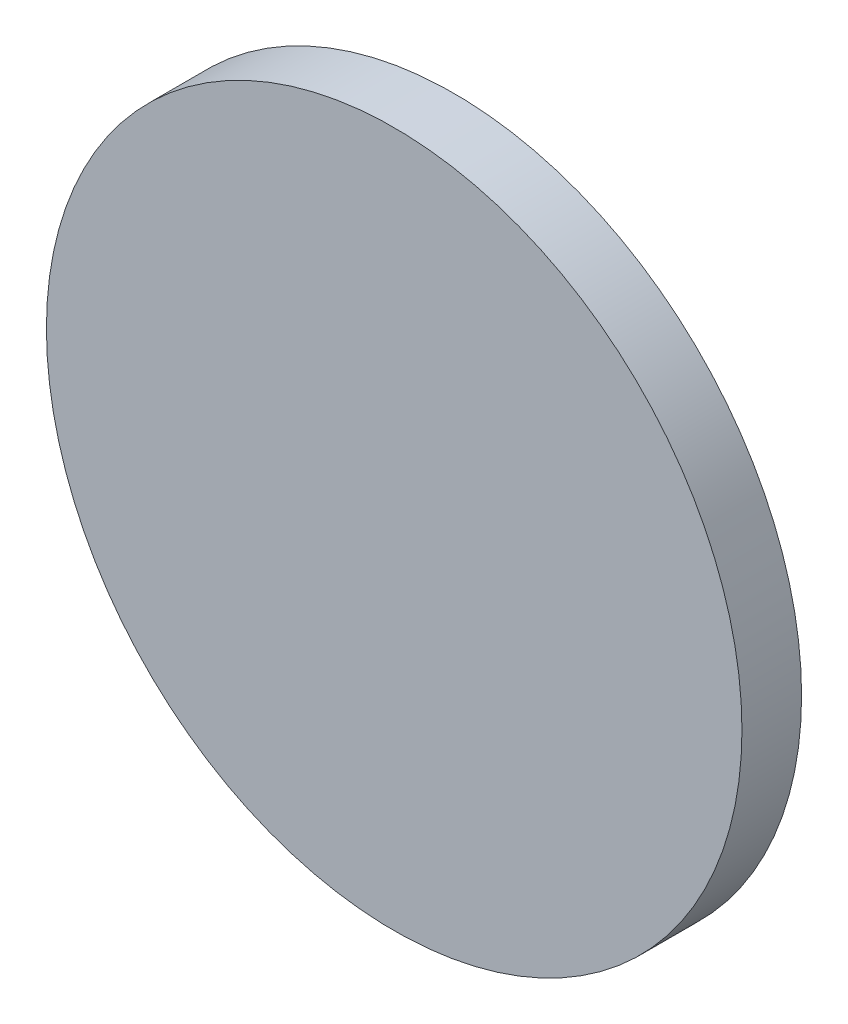
ISO-10303-21;
HEADER;
FILE_DESCRIPTION(('STEP AP214'),'2;1');
FILE_NAME('part.step','',(''),(''),'','','');
FILE_SCHEMA(('AUTOMOTIVE_DESIGN { 1 0 10303 214 1 1 1 1 }'));
ENDSEC;
DATA;
#1=APPLICATION_CONTEXT('core data for automotive mechanical design processes');
#2=APPLICATION_PROTOCOL_DEFINITION('international standard','automotive_design',2000,#1);
#3=PRODUCT_CONTEXT('',#1,'mechanical');
#4=PRODUCT('Part','Part','',(#3));
#5=PRODUCT_RELATED_PRODUCT_CATEGORY('part','',(#4));
#6=PRODUCT_DEFINITION_FORMATION('','',#4);
#7=PRODUCT_DEFINITION_CONTEXT('part definition',#1,'design');
#8=PRODUCT_DEFINITION('design','',#6,#7);
#9=PRODUCT_DEFINITION_SHAPE('','',#8);
#10=(LENGTH_UNIT() NAMED_UNIT(*) SI_UNIT(.MILLI.,.METRE.));
#11=(NAMED_UNIT(*) PLANE_ANGLE_UNIT() SI_UNIT($,.RADIAN.));
#12=(NAMED_UNIT(*) SI_UNIT($,.STERADIAN.) SOLID_ANGLE_UNIT());
#13=UNCERTAINTY_MEASURE_WITH_UNIT(LENGTH_MEASURE(1.E-05),#10,'distance_accuracy_value','');
#14=(GEOMETRIC_REPRESENTATION_CONTEXT(3) GLOBAL_UNCERTAINTY_ASSIGNED_CONTEXT((#13)) GLOBAL_UNIT_ASSIGNED_CONTEXT((#10,
#11,#12)) REPRESENTATION_CONTEXT('',''));
#15=CARTESIAN_POINT('',(0.,0.,0.));
#16=DIRECTION('',(0.,0.,1.));
#17=DIRECTION('',(1.,0.,0.));
#18=AXIS2_PLACEMENT_3D('',#15,#16,#17);
#19=CARTESIAN_POINT('',(7.9756,1.97358,0.));
#20=DIRECTION('',(0.,0.,-1.));
#21=DIRECTION('',(-1.,0.,0.));
#22=AXIS2_PLACEMENT_3D('',#19,#20,#21);
#23=PLANE('',#22);
#24=CARTESIAN_POINT('',(7.9756,1.97358,0.));
#25=DIRECTION('',(0.,0.,1.));
#26=DIRECTION('',(1.,0.,0.));
#27=AXIS2_PLACEMENT_3D('',#24,#25,#26);
#28=CIRCLE('',#27,0.200024667);
#29=CARTESIAN_POINT('',(8.175624667,1.97358,0.));
#30=VERTEX_POINT('',#29);
#31=EDGE_CURVE('E18',#30,#30,#28,.T.);
#32=ORIENTED_EDGE('',*,*,#31,.F.);
#33=EDGE_LOOP('',(#32));
#34=FACE_BOUND('',#33,.T.);
#35=ADVANCED_FACE('F15',(#34),#23,.T.);
#36=CARTESIAN_POINT('',(7.9756,1.97358,0.));
#37=DIRECTION('',(0.,0.,1.));
#38=DIRECTION('',(1.,0.,0.));
#39=AXIS2_PLACEMENT_3D('',#36,#37,#38);
#40=CYLINDRICAL_SURFACE('',#39,0.200024667);
#41=CARTESIAN_POINT('',(7.9756,1.97358,0.03429));
#42=DIRECTION('',(0.,0.,1.));
#43=DIRECTION('',(1.,0.,0.));
#44=AXIS2_PLACEMENT_3D('',#41,#42,#43);
#45=CIRCLE('',#44,0.200024667);
#46=CARTESIAN_POINT('',(8.175624667,1.97358,0.03429));
#47=VERTEX_POINT('',#46);
#48=EDGE_CURVE('E10',#47,#47,#45,.T.);
#49=ORIENTED_EDGE('',*,*,#48,.F.);
#50=EDGE_LOOP('',(#49));
#51=FACE_BOUND('',#50,.T.);
#52=ORIENTED_EDGE('',*,*,#31,.T.);
#53=EDGE_LOOP('',(#52));
#54=FACE_BOUND('',#53,.T.);
#55=ADVANCED_FACE('F27',(#51,#54),#40,.T.);
#56=CARTESIAN_POINT('',(7.9756,1.97358,0.03429));
#57=DIRECTION('',(0.,0.,1.));
#58=DIRECTION('',(1.,0.,0.));
#59=AXIS2_PLACEMENT_3D('',#56,#57,#58);
#60=PLANE('',#59);
#61=ORIENTED_EDGE('',*,*,#48,.T.);
#62=EDGE_LOOP('',(#61));
#63=FACE_BOUND('',#62,.T.);
#64=ADVANCED_FACE('F34',(#63),#60,.T.);
#65=CLOSED_SHELL('',(#35,#55,#64));
#66=MANIFOLD_SOLID_BREP('B1',#65);
#67=ADVANCED_BREP_SHAPE_REPRESENTATION('',(#18,#66),#14);
#68=SHAPE_DEFINITION_REPRESENTATION(#9,#67);
ENDSEC;
END-ISO-10303-21;
